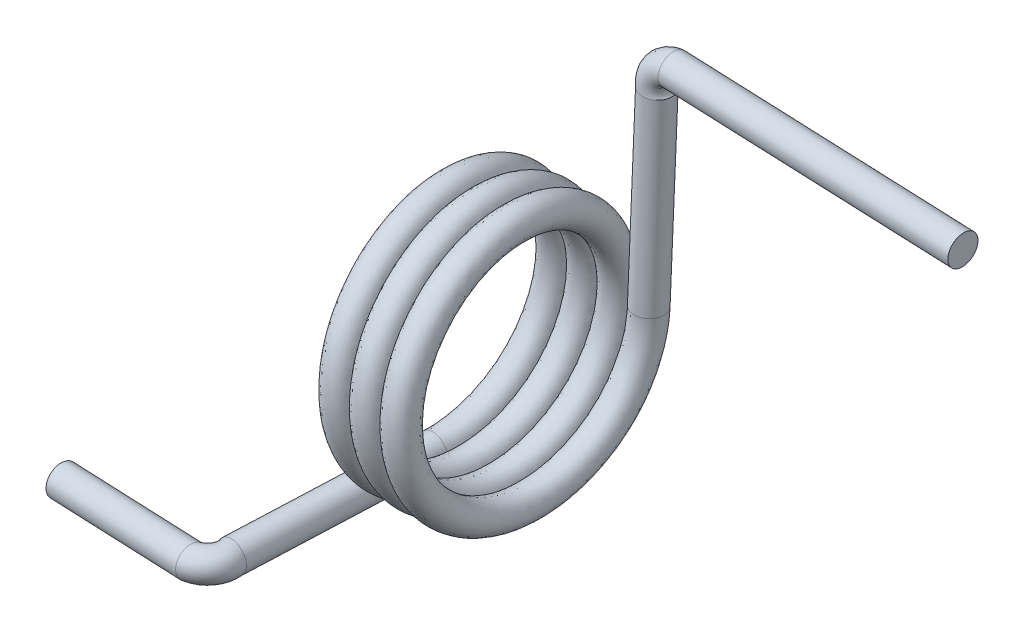
ISO-10303-21;
HEADER;
FILE_DESCRIPTION(('STEP AP214'),'2;1');
FILE_NAME('part.step','',(''),(''),'','','');
FILE_SCHEMA(('AUTOMOTIVE_DESIGN { 1 0 10303 214 1 1 1 1 }'));
ENDSEC;
DATA;
#1=APPLICATION_CONTEXT('core data for automotive mechanical design processes');
#2=APPLICATION_PROTOCOL_DEFINITION('international standard','automotive_design',2000,#1);
#3=PRODUCT_CONTEXT('',#1,'mechanical');
#4=PRODUCT('Part','Part','',(#3));
#5=PRODUCT_RELATED_PRODUCT_CATEGORY('part','',(#4));
#6=PRODUCT_DEFINITION_FORMATION('','',#4);
#7=PRODUCT_DEFINITION_CONTEXT('part definition',#1,'design');
#8=PRODUCT_DEFINITION('design','',#6,#7);
#9=PRODUCT_DEFINITION_SHAPE('','',#8);
#10=(LENGTH_UNIT() NAMED_UNIT(*) SI_UNIT(.MILLI.,.METRE.));
#11=(NAMED_UNIT(*) PLANE_ANGLE_UNIT() SI_UNIT($,.RADIAN.));
#12=(NAMED_UNIT(*) SI_UNIT($,.STERADIAN.) SOLID_ANGLE_UNIT());
#13=UNCERTAINTY_MEASURE_WITH_UNIT(LENGTH_MEASURE(1.E-05),#10,'distance_accuracy_value','');
#14=(GEOMETRIC_REPRESENTATION_CONTEXT(3) GLOBAL_UNCERTAINTY_ASSIGNED_CONTEXT((#13)) GLOBAL_UNIT_ASSIGNED_CONTEXT((#10,
#11,#12)) REPRESENTATION_CONTEXT('',''));
#15=CARTESIAN_POINT('',(0.,0.,0.));
#16=DIRECTION('',(0.,0.,1.));
#17=DIRECTION('',(1.,0.,0.));
#18=AXIS2_PLACEMENT_3D('',#15,#16,#17);
#19=CARTESIAN_POINT('',(-0.989731142426947,-7.62,-0.0414804256277122));
#20=CARTESIAN_POINT('',(-0.822514475760281,-7.59605126509774,-4.44088947685266));
#21=CARTESIAN_POINT('',(-0.655297809093615,-3.77407689764661,-6.61985378965128));
#22=CARTESIAN_POINT('',(-0.488081142426948,0.0478974698045193,-8.7988181024499));
#23=CARTESIAN_POINT('',(-0.320864475760282,3.84592310235339,-6.57837336402357));
#24=CARTESIAN_POINT('',(-0.153647809093616,7.64394873490226,-4.35792862559724));
#25=CARTESIAN_POINT('',(0.0135688575730504,7.62,0.0414804256277113));
#26=CARTESIAN_POINT('',(0.180785524239717,7.59605126509775,4.44088947685266));
#27=CARTESIAN_POINT('',(0.348002190906383,3.77407689764661,6.61985378965128));
#28=CARTESIAN_POINT('',(0.515218857573049,-0.0478974698045182,8.7988181024499));
#29=CARTESIAN_POINT('',(0.682435524239716,-3.84592310235339,6.57837336402357));
#30=CARTESIAN_POINT('',(0.849652190906382,-7.64394873490226,4.35792862559724));
#31=CARTESIAN_POINT('',(1.01686885757305,-7.62,-0.0414804256277122));
#32=CARTESIAN_POINT('',(1.18408552423971,-7.59605126509774,-4.44088947685266));
#33=CARTESIAN_POINT('',(1.35130219090638,-3.77407689764661,-6.61985378965128));
#34=CARTESIAN_POINT('',(1.51851885757305,0.0478974698045193,-8.7988181024499));
#35=CARTESIAN_POINT('',(1.68573552423971,3.84592310235339,-6.57837336402357));
#36=CARTESIAN_POINT('',(1.85295219090638,7.64394873490226,-4.35792862559724));
#37=CARTESIAN_POINT('',(2.02016885757305,7.62,0.0414804256277113));
#38=CARTESIAN_POINT('',(2.18738552423971,7.59605126509775,4.44088947685266));
#39=CARTESIAN_POINT('',(2.35460219090638,3.77407689764661,6.61985378965128));
#40=CARTESIAN_POINT('',(2.52181885757304,-0.0478974698045182,8.7988181024499));
#41=CARTESIAN_POINT('',(2.68903552423971,-3.84592310235339,6.57837336402357));
#42=CARTESIAN_POINT('',(2.85625219090638,-7.64394873490226,4.35792862559724));
#43=CARTESIAN_POINT('',(3.02346885757304,-7.62,-0.0414804256277122));
#44=CARTESIAN_POINT('',(3.19068552423971,-7.59605126509774,-4.44088947685266));
#45=CARTESIAN_POINT('',(3.35790219090638,-3.77407689764661,-6.61985378965128));
#46=CARTESIAN_POINT('',(3.52511885757304,0.0478974698045193,-8.7988181024499));
#47=CARTESIAN_POINT('',(3.69233552423971,3.84592310235339,-6.57837336402357));
#48=CARTESIAN_POINT('',(3.85955219090638,7.64394873490226,-4.35792862559724));
#49=CARTESIAN_POINT('',(4.02676885757304,7.62,0.0414804256277113));
#50=CARTESIAN_POINT('',(4.19398552423971,7.59605126509775,4.44088947685266));
#51=CARTESIAN_POINT('',(4.36120219090637,3.77407689764661,6.61985378965128));
#52=CARTESIAN_POINT('',(4.52841885757304,-0.0478974698045182,8.7988181024499));
#53=CARTESIAN_POINT('',(4.69563552423971,-3.84592310235339,6.57837336402357));
#54=CARTESIAN_POINT('',(4.86285219090637,-7.64394873490226,4.35792862559724));
#55=CARTESIAN_POINT('',(5.03006885757304,-7.62,-0.0414804256277122));
#56=CARTESIAN_POINT('',(5.1972855242397,-7.59605126509774,-4.44088947685266));
#57=CARTESIAN_POINT('',(5.36450219090637,-3.77407689764661,-6.61985378965128));
#58=CARTESIAN_POINT('',(5.53171885757304,0.0478974698045193,-8.7988181024499));
#59=CARTESIAN_POINT('',(5.6989355242397,3.84592310235339,-6.57837336402357));
#60=CARTESIAN_POINT('',(5.86615219090637,7.64394873490226,-4.35792862559724));
#61=CARTESIAN_POINT('',(6.03336885757304,7.62,0.0414804256277113));
#62=CARTESIAN_POINT('',(6.2005855242397,7.59605126509775,4.44088947685266));
#63=CARTESIAN_POINT('',(6.36780219090637,3.77407689764661,6.61985378965128));
#64=CARTESIAN_POINT('',(6.53501885757303,-0.0478974698045182,8.7988181024499));
#65=CARTESIAN_POINT('',(6.7022355242397,-3.84592310235339,6.57837336402357));
#66=CARTESIAN_POINT('',(6.86945219090637,-7.64394873490226,4.35792862559724));
#67=CARTESIAN_POINT('',(7.03666885757303,-7.62,-0.0414804256277122));
#68=CARTESIAN_POINT('',(-0.989731142426948,-5.6388,-0.0414804256276918));
#69=CARTESIAN_POINT('',(-0.822514475760282,-5.61485126509776,-3.29704312353415));
#70=CARTESIAN_POINT('',(-0.655297809093615,-2.78347689764663,-4.90408425967354));
#71=CARTESIAN_POINT('',(-0.488081142426949,0.0478974698044959,-6.51112539581293));
#72=CARTESIAN_POINT('',(-0.320864475760283,2.85532310235337,-4.86260383404585));
#73=CARTESIAN_POINT('',(-0.153647809093617,5.66274873490225,-3.21408227227877));
#74=CARTESIAN_POINT('',(0.0135688575730495,5.6388,0.0414804256276912));
#75=CARTESIAN_POINT('',(0.180785524239716,5.61485126509776,3.29704312353415));
#76=CARTESIAN_POINT('',(0.348002190906382,2.78347689764663,4.90408425967354));
#77=CARTESIAN_POINT('',(0.515218857573049,-0.0478974698044951,6.51112539581293));
#78=CARTESIAN_POINT('',(0.682435524239715,-2.85532310235337,4.86260383404585));
#79=CARTESIAN_POINT('',(0.849652190906381,-5.66274873490225,3.21408227227877));
#80=CARTESIAN_POINT('',(1.01686885757305,-5.6388,-0.0414804256276918));
#81=CARTESIAN_POINT('',(1.18408552423971,-5.61485126509776,-3.29704312353415));
#82=CARTESIAN_POINT('',(1.35130219090638,-2.78347689764663,-4.90408425967354));
#83=CARTESIAN_POINT('',(1.51851885757305,0.0478974698044959,-6.51112539581293));
#84=CARTESIAN_POINT('',(1.68573552423971,2.85532310235337,-4.86260383404585));
#85=CARTESIAN_POINT('',(1.85295219090638,5.66274873490225,-3.21408227227877));
#86=CARTESIAN_POINT('',(2.02016885757304,5.6388,0.0414804256276912));
#87=CARTESIAN_POINT('',(2.18738552423971,5.61485126509776,3.29704312353415));
#88=CARTESIAN_POINT('',(2.35460219090638,2.78347689764663,4.90408425967354));
#89=CARTESIAN_POINT('',(2.52181885757304,-0.0478974698044951,6.51112539581293));
#90=CARTESIAN_POINT('',(2.68903552423971,-2.85532310235337,4.86260383404585));
#91=CARTESIAN_POINT('',(2.85625219090638,-5.66274873490225,3.21408227227877));
#92=CARTESIAN_POINT('',(3.02346885757304,-5.6388,-0.0414804256276918));
#93=CARTESIAN_POINT('',(3.19068552423971,-5.61485126509776,-3.29704312353415));
#94=CARTESIAN_POINT('',(3.35790219090638,-2.78347689764663,-4.90408425967354));
#95=CARTESIAN_POINT('',(3.52511885757304,0.0478974698044959,-6.51112539581293));
#96=CARTESIAN_POINT('',(3.69233552423971,2.85532310235337,-4.86260383404585));
#97=CARTESIAN_POINT('',(3.85955219090637,5.66274873490225,-3.21408227227877));
#98=CARTESIAN_POINT('',(4.02676885757304,5.6388,0.0414804256276912));
#99=CARTESIAN_POINT('',(4.19398552423971,5.61485126509776,3.29704312353415));
#100=CARTESIAN_POINT('',(4.36120219090637,2.78347689764663,4.90408425967354));
#101=CARTESIAN_POINT('',(4.52841885757304,-0.0478974698044951,6.51112539581293));
#102=CARTESIAN_POINT('',(4.69563552423971,-2.85532310235337,4.86260383404585));
#103=CARTESIAN_POINT('',(4.86285219090637,-5.66274873490225,3.21408227227877));
#104=CARTESIAN_POINT('',(5.03006885757304,-5.6388,-0.0414804256276918));
#105=CARTESIAN_POINT('',(5.1972855242397,-5.61485126509776,-3.29704312353415));
#106=CARTESIAN_POINT('',(5.36450219090637,-2.78347689764663,-4.90408425967354));
#107=CARTESIAN_POINT('',(5.53171885757304,0.0478974698044959,-6.51112539581293));
#108=CARTESIAN_POINT('',(5.6989355242397,2.85532310235337,-4.86260383404585));
#109=CARTESIAN_POINT('',(5.86615219090637,5.66274873490225,-3.21408227227877));
#110=CARTESIAN_POINT('',(6.03336885757304,5.6388,0.0414804256276912));
#111=CARTESIAN_POINT('',(6.2005855242397,5.61485126509776,3.29704312353415));
#112=CARTESIAN_POINT('',(6.36780219090637,2.78347689764663,4.90408425967354));
#113=CARTESIAN_POINT('',(6.53501885757303,-0.0478974698044951,6.51112539581293));
#114=CARTESIAN_POINT('',(6.7022355242397,-2.85532310235337,4.86260383404585));
#115=CARTESIAN_POINT('',(6.86945219090637,-5.66274873490225,3.21408227227877));
#116=CARTESIAN_POINT('',(7.03666885757303,-5.6388,-0.0414804256276918));
#117=CARTESIAN_POINT('',(0.989731142426946,-5.6388,0.041480425627573));
#118=CARTESIAN_POINT('',(1.15694780909361,-5.66274873490218,-3.21408227227889));
#119=CARTESIAN_POINT('',(1.32416447576028,-2.85532310235327,-4.86260383404591));
#120=CARTESIAN_POINT('',(1.49138114242695,-0.0478974698043594,-6.51112539581293));
#121=CARTESIAN_POINT('',(1.65859780909361,2.78347689764673,-4.90408425967348));
#122=CARTESIAN_POINT('',(1.82581447576028,5.61485126509782,-3.29704312353404));
#123=CARTESIAN_POINT('',(1.99303114242694,5.6388,-0.0414804256275737));
#124=CARTESIAN_POINT('',(2.16024780909361,5.66274873490218,3.21408227227889));
#125=CARTESIAN_POINT('',(2.32746447576028,2.85532310235327,4.86260383404591));
#126=CARTESIAN_POINT('',(2.49468114242694,0.0478974698043602,6.51112539581293));
#127=CARTESIAN_POINT('',(2.66189780909361,-2.78347689764673,4.90408425967348));
#128=CARTESIAN_POINT('',(2.82911447576028,-5.61485126509782,3.29704312353404));
#129=CARTESIAN_POINT('',(2.99633114242694,-5.6388,0.041480425627573));
#130=CARTESIAN_POINT('',(3.16354780909361,-5.66274873490218,-3.21408227227889));
#131=CARTESIAN_POINT('',(3.33076447576027,-2.85532310235327,-4.86260383404591));
#132=CARTESIAN_POINT('',(3.49798114242694,-0.0478974698043594,-6.51112539581293));
#133=CARTESIAN_POINT('',(3.66519780909361,2.78347689764673,-4.90408425967348));
#134=CARTESIAN_POINT('',(3.83241447576027,5.61485126509782,-3.29704312353404));
#135=CARTESIAN_POINT('',(3.99963114242694,5.6388,-0.0414804256275737));
#136=CARTESIAN_POINT('',(4.16684780909361,5.66274873490218,3.21408227227889));
#137=CARTESIAN_POINT('',(4.33406447576027,2.85532310235327,4.86260383404591));
#138=CARTESIAN_POINT('',(4.50128114242694,0.0478974698043602,6.51112539581293));
#139=CARTESIAN_POINT('',(4.6684978090936,-2.78347689764673,4.90408425967348));
#140=CARTESIAN_POINT('',(4.83571447576027,-5.61485126509782,3.29704312353404));
#141=CARTESIAN_POINT('',(5.00293114242694,-5.6388,0.041480425627573));
#142=CARTESIAN_POINT('',(5.1701478090936,-5.66274873490218,-3.21408227227889));
#143=CARTESIAN_POINT('',(5.33736447576027,-2.85532310235327,-4.86260383404591));
#144=CARTESIAN_POINT('',(5.50458114242694,-0.0478974698043594,-6.51112539581293));
#145=CARTESIAN_POINT('',(5.6717978090936,2.78347689764673,-4.90408425967348));
#146=CARTESIAN_POINT('',(5.83901447576027,5.61485126509782,-3.29704312353404));
#147=CARTESIAN_POINT('',(6.00623114242693,5.6388,-0.0414804256275737));
#148=CARTESIAN_POINT('',(6.1734478090936,5.66274873490218,3.21408227227889));
#149=CARTESIAN_POINT('',(6.34066447576027,2.85532310235327,4.86260383404591));
#150=CARTESIAN_POINT('',(6.50788114242693,0.0478974698043602,6.51112539581293));
#151=CARTESIAN_POINT('',(6.6750978090936,-2.78347689764673,4.90408425967348));
#152=CARTESIAN_POINT('',(6.84231447576027,-5.61485126509782,3.29704312353404));
#153=CARTESIAN_POINT('',(7.00953114242693,-5.6388,0.041480425627573));
#154=CARTESIAN_POINT('',(7.1767478090936,-5.66274873490218,-3.21408227227889));
#155=CARTESIAN_POINT('',(7.34396447576026,-2.85532310235327,-4.86260383404591));
#156=CARTESIAN_POINT('',(7.51118114242693,-0.0478974698043594,-6.51112539581293));
#157=CARTESIAN_POINT('',(7.6783978090936,2.78347689764673,-4.90408425967348));
#158=CARTESIAN_POINT('',(7.84561447576026,5.61485126509782,-3.29704312353404));
#159=CARTESIAN_POINT('',(8.01283114242693,5.6388,-0.0414804256275737));
#160=CARTESIAN_POINT('',(8.1800478090936,5.66274873490218,3.21408227227889));
#161=CARTESIAN_POINT('',(8.34726447576026,2.85532310235327,4.86260383404591));
#162=CARTESIAN_POINT('',(8.51448114242693,0.0478974698043602,6.51112539581293));
#163=CARTESIAN_POINT('',(8.6816978090936,-2.78347689764673,4.90408425967348));
#164=CARTESIAN_POINT('',(8.84891447576026,-5.61485126509782,3.29704312353404));
#165=CARTESIAN_POINT('',(9.01613114242693,-5.6388,0.041480425627573));
#166=CARTESIAN_POINT('',(0.989731142426948,-7.62,0.0414804256275526));
#167=CARTESIAN_POINT('',(1.15694780909361,-7.64394873490217,-4.3579286255974));
#168=CARTESIAN_POINT('',(1.32416447576028,-3.84592310235325,-6.57837336402365));
#169=CARTESIAN_POINT('',(1.49138114242695,-0.047897469804336,-8.7988181024499));
#170=CARTESIAN_POINT('',(1.65859780909361,3.77407689764675,-6.6198537896512));
#171=CARTESIAN_POINT('',(1.82581447576028,7.59605126509783,-4.4408894768525));
#172=CARTESIAN_POINT('',(1.99303114242695,7.62,-0.0414804256275535));
#173=CARTESIAN_POINT('',(2.16024780909361,7.64394873490217,4.35792862559739));
#174=CARTESIAN_POINT('',(2.32746447576028,3.84592310235326,6.57837336402365));
#175=CARTESIAN_POINT('',(2.49468114242694,0.0478974698043371,8.7988181024499));
#176=CARTESIAN_POINT('',(2.66189780909361,-3.77407689764674,6.6198537896512));
#177=CARTESIAN_POINT('',(2.82911447576028,-7.59605126509783,4.44088947685251));
#178=CARTESIAN_POINT('',(2.99633114242694,-7.62,0.0414804256275526));
#179=CARTESIAN_POINT('',(3.16354780909361,-7.64394873490217,-4.3579286255974));
#180=CARTESIAN_POINT('',(3.33076447576028,-3.84592310235325,-6.57837336402365));
#181=CARTESIAN_POINT('',(3.49798114242694,-0.047897469804336,-8.7988181024499));
#182=CARTESIAN_POINT('',(3.66519780909361,3.77407689764675,-6.6198537896512));
#183=CARTESIAN_POINT('',(3.83241447576027,7.59605126509783,-4.4408894768525));
#184=CARTESIAN_POINT('',(3.99963114242694,7.62,-0.0414804256275535));
#185=CARTESIAN_POINT('',(4.16684780909361,7.64394873490217,4.35792862559739));
#186=CARTESIAN_POINT('',(4.33406447576027,3.84592310235326,6.57837336402365));
#187=CARTESIAN_POINT('',(4.50128114242694,0.0478974698043371,8.7988181024499));
#188=CARTESIAN_POINT('',(4.6684978090936,-3.77407689764674,6.6198537896512));
#189=CARTESIAN_POINT('',(4.83571447576027,-7.59605126509783,4.44088947685251));
#190=CARTESIAN_POINT('',(5.00293114242694,-7.62,0.0414804256275526));
#191=CARTESIAN_POINT('',(5.1701478090936,-7.64394873490217,-4.3579286255974));
#192=CARTESIAN_POINT('',(5.33736447576027,-3.84592310235325,-6.57837336402365));
#193=CARTESIAN_POINT('',(5.50458114242694,-0.047897469804336,-8.7988181024499));
#194=CARTESIAN_POINT('',(5.6717978090936,3.77407689764675,-6.6198537896512));
#195=CARTESIAN_POINT('',(5.83901447576027,7.59605126509783,-4.4408894768525));
#196=CARTESIAN_POINT('',(6.00623114242694,7.62,-0.0414804256275535));
#197=CARTESIAN_POINT('',(6.1734478090936,7.64394873490217,4.35792862559739));
#198=CARTESIAN_POINT('',(6.34066447576027,3.84592310235326,6.57837336402365));
#199=CARTESIAN_POINT('',(6.50788114242693,0.0478974698043371,8.7988181024499));
#200=CARTESIAN_POINT('',(6.6750978090936,-3.77407689764674,6.6198537896512));
#201=CARTESIAN_POINT('',(6.84231447576027,-7.59605126509783,4.44088947685251));
#202=CARTESIAN_POINT('',(7.00953114242693,-7.62,0.0414804256275526));
#203=CARTESIAN_POINT('',(7.1767478090936,-7.64394873490217,-4.3579286255974));
#204=CARTESIAN_POINT('',(7.34396447576027,-3.84592310235325,-6.57837336402365));
#205=CARTESIAN_POINT('',(7.51118114242693,-0.047897469804336,-8.7988181024499));
#206=CARTESIAN_POINT('',(7.6783978090936,3.77407689764675,-6.6198537896512));
#207=CARTESIAN_POINT('',(7.84561447576027,7.59605126509783,-4.4408894768525));
#208=CARTESIAN_POINT('',(8.01283114242693,7.62,-0.0414804256275535));
#209=CARTESIAN_POINT('',(8.1800478090936,7.64394873490217,4.35792862559739));
#210=CARTESIAN_POINT('',(8.34726447576026,3.84592310235326,6.57837336402365));
#211=CARTESIAN_POINT('',(8.51448114242693,0.0478974698043371,8.7988181024499));
#212=CARTESIAN_POINT('',(8.6816978090936,-3.77407689764674,6.6198537896512));
#213=CARTESIAN_POINT('',(8.84891447576026,-7.59605126509783,4.44088947685251));
#214=CARTESIAN_POINT('',(9.01613114242693,-7.62,0.0414804256275526));
#215=CARTESIAN_POINT('',(0.989731142426949,-9.6012,0.0414804256275322));
#216=CARTESIAN_POINT('',(1.15694780909361,-9.62514873490216,-5.5017749789159));
#217=CARTESIAN_POINT('',(1.32416447576028,-4.83652310235324,-8.29414289400139));
#218=CARTESIAN_POINT('',(1.49138114242695,-0.0478974698043126,-11.0865108090869));
#219=CARTESIAN_POINT('',(1.65859780909361,4.76467689764677,-8.33562331962892));
#220=CARTESIAN_POINT('',(1.82581447576028,9.57725126509784,-5.58473583017097));
#221=CARTESIAN_POINT('',(1.99303114242695,9.6012,-0.0414804256275334));
#222=CARTESIAN_POINT('',(2.16024780909361,9.62514873490216,5.5017749789159));
#223=CARTESIAN_POINT('',(2.32746447576028,4.83652310235324,8.29414289400139));
#224=CARTESIAN_POINT('',(2.49468114242695,0.047897469804314,11.0865108090869));
#225=CARTESIAN_POINT('',(2.66189780909361,-4.76467689764676,8.33562331962892));
#226=CARTESIAN_POINT('',(2.82911447576028,-9.57725126509784,5.58473583017097));
#227=CARTESIAN_POINT('',(2.99633114242694,-9.6012,0.0414804256275322));
#228=CARTESIAN_POINT('',(3.16354780909361,-9.62514873490216,-5.5017749789159));
#229=CARTESIAN_POINT('',(3.33076447576028,-4.83652310235324,-8.29414289400139));
#230=CARTESIAN_POINT('',(3.49798114242694,-0.0478974698043126,-11.0865108090869));
#231=CARTESIAN_POINT('',(3.66519780909361,4.76467689764677,-8.33562331962892));
#232=CARTESIAN_POINT('',(3.83241447576028,9.57725126509784,-5.58473583017097));
#233=CARTESIAN_POINT('',(3.99963114242694,9.6012,-0.0414804256275334));
#234=CARTESIAN_POINT('',(4.16684780909361,9.62514873490216,5.5017749789159));
#235=CARTESIAN_POINT('',(4.33406447576027,4.83652310235324,8.29414289400139));
#236=CARTESIAN_POINT('',(4.50128114242694,0.047897469804314,11.0865108090869));
#237=CARTESIAN_POINT('',(4.66849780909361,-4.76467689764676,8.33562331962892));
#238=CARTESIAN_POINT('',(4.83571447576027,-9.57725126509784,5.58473583017097));
#239=CARTESIAN_POINT('',(5.00293114242694,-9.6012,0.0414804256275322));
#240=CARTESIAN_POINT('',(5.17014780909361,-9.62514873490216,-5.5017749789159));
#241=CARTESIAN_POINT('',(5.33736447576027,-4.83652310235324,-8.29414289400139));
#242=CARTESIAN_POINT('',(5.50458114242694,-0.0478974698043126,-11.0865108090869));
#243=CARTESIAN_POINT('',(5.6717978090936,4.76467689764677,-8.33562331962892));
#244=CARTESIAN_POINT('',(5.83901447576027,9.57725126509784,-5.58473583017097));
#245=CARTESIAN_POINT('',(6.00623114242694,9.6012,-0.0414804256275334));
#246=CARTESIAN_POINT('',(6.1734478090936,9.62514873490216,5.5017749789159));
#247=CARTESIAN_POINT('',(6.34066447576027,4.83652310235324,8.29414289400139));
#248=CARTESIAN_POINT('',(6.50788114242693,0.047897469804314,11.0865108090869));
#249=CARTESIAN_POINT('',(6.6750978090936,-4.76467689764676,8.33562331962892));
#250=CARTESIAN_POINT('',(6.84231447576027,-9.57725126509784,5.58473583017097));
#251=CARTESIAN_POINT('',(7.00953114242694,-9.6012,0.0414804256275322));
#252=CARTESIAN_POINT('',(7.1767478090936,-9.62514873490216,-5.5017749789159));
#253=CARTESIAN_POINT('',(7.34396447576027,-4.83652310235324,-8.29414289400139));
#254=CARTESIAN_POINT('',(7.51118114242693,-0.0478974698043126,-11.0865108090869));
#255=CARTESIAN_POINT('',(7.6783978090936,4.76467689764677,-8.33562331962892));
#256=CARTESIAN_POINT('',(7.84561447576027,9.57725126509784,-5.58473583017097));
#257=CARTESIAN_POINT('',(8.01283114242693,9.6012,-0.0414804256275334));
#258=CARTESIAN_POINT('',(8.1800478090936,9.62514873490216,5.5017749789159));
#259=CARTESIAN_POINT('',(8.34726447576026,4.83652310235324,8.29414289400139));
#260=CARTESIAN_POINT('',(8.51448114242693,0.047897469804314,11.0865108090869));
#261=CARTESIAN_POINT('',(8.6816978090936,-4.76467689764676,8.33562331962892));
#262=CARTESIAN_POINT('',(8.84891447576026,-9.57725126509784,5.58473583017097));
#263=CARTESIAN_POINT('',(9.01613114242693,-9.6012,0.0414804256275322));
#264=CARTESIAN_POINT('',(-0.989731142426946,-9.6012,-0.0414804256277326));
#265=CARTESIAN_POINT('',(-0.82251447576028,-9.57725126509773,-5.58473583017117));
#266=CARTESIAN_POINT('',(-0.655297809093614,-4.76467689764659,-8.33562331962902));
#267=CARTESIAN_POINT('',(-0.488081142426948,0.0478974698045427,-11.0865108090869));
#268=CARTESIAN_POINT('',(-0.320864475760281,4.83652310235341,-8.29414289400129));
#269=CARTESIAN_POINT('',(-0.153647809093615,9.62514873490227,-5.50177497891571));
#270=CARTESIAN_POINT('',(0.0135688575730512,9.6012,0.0414804256277314));
#271=CARTESIAN_POINT('',(0.180785524239718,9.57725126509773,5.58473583017117));
#272=CARTESIAN_POINT('',(0.348002190906384,4.7646768976466,8.33562331962902));
#273=CARTESIAN_POINT('',(0.51521885757305,-0.0478974698045413,11.0865108090869));
#274=CARTESIAN_POINT('',(0.682435524239716,-4.8365231023534,8.29414289400129));
#275=CARTESIAN_POINT('',(0.849652190906383,-9.62514873490227,5.50177497891571));
#276=CARTESIAN_POINT('',(1.01686885757305,-9.6012,-0.0414804256277326));
#277=CARTESIAN_POINT('',(1.18408552423972,-9.57725126509773,-5.58473583017117));
#278=CARTESIAN_POINT('',(1.35130219090638,-4.76467689764659,-8.33562331962902));
#279=CARTESIAN_POINT('',(1.51851885757305,0.0478974698045427,-11.0865108090869));
#280=CARTESIAN_POINT('',(1.68573552423971,4.83652310235341,-8.29414289400129));
#281=CARTESIAN_POINT('',(1.85295219090638,9.62514873490227,-5.50177497891571));
#282=CARTESIAN_POINT('',(2.02016885757305,9.6012,0.0414804256277314));
#283=CARTESIAN_POINT('',(2.18738552423971,9.57725126509773,5.58473583017117));
#284=CARTESIAN_POINT('',(2.35460219090638,4.7646768976466,8.33562331962902));
#285=CARTESIAN_POINT('',(2.52181885757305,-0.0478974698045413,11.0865108090869));
#286=CARTESIAN_POINT('',(2.68903552423971,-4.8365231023534,8.29414289400129));
#287=CARTESIAN_POINT('',(2.85625219090638,-9.62514873490227,5.50177497891571));
#288=CARTESIAN_POINT('',(3.02346885757304,-9.6012,-0.0414804256277326));
#289=CARTESIAN_POINT('',(3.19068552423971,-9.57725126509773,-5.58473583017117));
#290=CARTESIAN_POINT('',(3.35790219090638,-4.76467689764659,-8.33562331962902));
#291=CARTESIAN_POINT('',(3.52511885757304,0.0478974698045427,-11.0865108090869));
#292=CARTESIAN_POINT('',(3.69233552423971,4.83652310235341,-8.29414289400129));
#293=CARTESIAN_POINT('',(3.85955219090638,9.62514873490227,-5.50177497891571));
#294=CARTESIAN_POINT('',(4.02676885757304,9.6012,0.0414804256277314));
#295=CARTESIAN_POINT('',(4.19398552423971,9.57725126509773,5.58473583017117));
#296=CARTESIAN_POINT('',(4.36120219090637,4.7646768976466,8.33562331962902));
#297=CARTESIAN_POINT('',(4.52841885757304,-0.0478974698045413,11.0865108090869));
#298=CARTESIAN_POINT('',(4.69563552423971,-4.8365231023534,8.29414289400129));
#299=CARTESIAN_POINT('',(4.86285219090637,-9.62514873490227,5.50177497891571));
#300=CARTESIAN_POINT('',(5.03006885757304,-9.6012,-0.0414804256277326));
#301=CARTESIAN_POINT('',(5.1972855242397,-9.57725126509773,-5.58473583017117));
#302=CARTESIAN_POINT('',(5.36450219090637,-4.76467689764659,-8.33562331962902));
#303=CARTESIAN_POINT('',(5.53171885757304,0.0478974698045427,-11.0865108090869));
#304=CARTESIAN_POINT('',(5.6989355242397,4.83652310235341,-8.29414289400129));
#305=CARTESIAN_POINT('',(5.86615219090637,9.62514873490227,-5.50177497891571));
#306=CARTESIAN_POINT('',(6.03336885757304,9.6012,0.0414804256277314));
#307=CARTESIAN_POINT('',(6.2005855242397,9.57725126509773,5.58473583017117));
#308=CARTESIAN_POINT('',(6.36780219090637,4.7646768976466,8.33562331962902));
#309=CARTESIAN_POINT('',(6.53501885757303,-0.0478974698045413,11.0865108090869));
#310=CARTESIAN_POINT('',(6.7022355242397,-4.8365231023534,8.29414289400129));
#311=CARTESIAN_POINT('',(6.86945219090637,-9.62514873490227,5.50177497891571));
#312=CARTESIAN_POINT('',(7.03666885757304,-9.6012,-0.0414804256277326));
#313=CARTESIAN_POINT('',(-0.989731142426947,-7.62,-0.0414804256277122));
#314=CARTESIAN_POINT('',(-0.822514475760281,-7.59605126509774,-4.44088947685266));
#315=CARTESIAN_POINT('',(-0.655297809093615,-3.77407689764661,-6.61985378965128));
#316=CARTESIAN_POINT('',(-0.488081142426948,0.0478974698045193,-8.7988181024499));
#317=CARTESIAN_POINT('',(-0.320864475760282,3.84592310235339,-6.57837336402357));
#318=CARTESIAN_POINT('',(-0.153647809093616,7.64394873490226,-4.35792862559724));
#319=CARTESIAN_POINT('',(0.0135688575730504,7.62,0.0414804256277113));
#320=CARTESIAN_POINT('',(0.180785524239717,7.59605126509775,4.44088947685266));
#321=CARTESIAN_POINT('',(0.348002190906383,3.77407689764661,6.61985378965128));
#322=CARTESIAN_POINT('',(0.515218857573049,-0.0478974698045182,8.7988181024499));
#323=CARTESIAN_POINT('',(0.682435524239716,-3.84592310235339,6.57837336402357));
#324=CARTESIAN_POINT('',(0.849652190906382,-7.64394873490226,4.35792862559724));
#325=CARTESIAN_POINT('',(1.01686885757305,-7.62,-0.0414804256277122));
#326=CARTESIAN_POINT('',(1.18408552423971,-7.59605126509774,-4.44088947685266));
#327=CARTESIAN_POINT('',(1.35130219090638,-3.77407689764661,-6.61985378965128));
#328=CARTESIAN_POINT('',(1.51851885757305,0.0478974698045193,-8.7988181024499));
#329=CARTESIAN_POINT('',(1.68573552423971,3.84592310235339,-6.57837336402357));
#330=CARTESIAN_POINT('',(1.85295219090638,7.64394873490226,-4.35792862559724));
#331=CARTESIAN_POINT('',(2.02016885757305,7.62,0.0414804256277113));
#332=CARTESIAN_POINT('',(2.18738552423971,7.59605126509775,4.44088947685266));
#333=CARTESIAN_POINT('',(2.35460219090638,3.77407689764661,6.61985378965128));
#334=CARTESIAN_POINT('',(2.52181885757304,-0.0478974698045182,8.7988181024499));
#335=CARTESIAN_POINT('',(2.68903552423971,-3.84592310235339,6.57837336402357));
#336=CARTESIAN_POINT('',(2.85625219090638,-7.64394873490226,4.35792862559724));
#337=CARTESIAN_POINT('',(3.02346885757304,-7.62,-0.0414804256277122));
#338=CARTESIAN_POINT('',(3.19068552423971,-7.59605126509774,-4.44088947685266));
#339=CARTESIAN_POINT('',(3.35790219090638,-3.77407689764661,-6.61985378965128));
#340=CARTESIAN_POINT('',(3.52511885757304,0.0478974698045193,-8.7988181024499));
#341=CARTESIAN_POINT('',(3.69233552423971,3.84592310235339,-6.57837336402357));
#342=CARTESIAN_POINT('',(3.85955219090638,7.64394873490226,-4.35792862559724));
#343=CARTESIAN_POINT('',(4.02676885757304,7.62,0.0414804256277113));
#344=CARTESIAN_POINT('',(4.19398552423971,7.59605126509775,4.44088947685266));
#345=CARTESIAN_POINT('',(4.36120219090637,3.77407689764661,6.61985378965128));
#346=CARTESIAN_POINT('',(4.52841885757304,-0.0478974698045182,8.7988181024499));
#347=CARTESIAN_POINT('',(4.69563552423971,-3.84592310235339,6.57837336402357));
#348=CARTESIAN_POINT('',(4.86285219090637,-7.64394873490226,4.35792862559724));
#349=CARTESIAN_POINT('',(5.03006885757304,-7.62,-0.0414804256277122));
#350=CARTESIAN_POINT('',(5.1972855242397,-7.59605126509774,-4.44088947685266));
#351=CARTESIAN_POINT('',(5.36450219090637,-3.77407689764661,-6.61985378965128));
#352=CARTESIAN_POINT('',(5.53171885757304,0.0478974698045193,-8.7988181024499));
#353=CARTESIAN_POINT('',(5.6989355242397,3.84592310235339,-6.57837336402357));
#354=CARTESIAN_POINT('',(5.86615219090637,7.64394873490226,-4.35792862559724));
#355=CARTESIAN_POINT('',(6.03336885757304,7.62,0.0414804256277113));
#356=CARTESIAN_POINT('',(6.2005855242397,7.59605126509775,4.44088947685266));
#357=CARTESIAN_POINT('',(6.36780219090637,3.77407689764661,6.61985378965128));
#358=CARTESIAN_POINT('',(6.53501885757303,-0.0478974698045182,8.7988181024499));
#359=CARTESIAN_POINT('',(6.7022355242397,-3.84592310235339,6.57837336402357));
#360=CARTESIAN_POINT('',(6.86945219090637,-7.64394873490226,4.35792862559724));
#361=CARTESIAN_POINT('',(7.03666885757303,-7.62,-0.0414804256277122));
#362=(BOUNDED_SURFACE() B_SPLINE_SURFACE(3,2,((#19,#20,#21,#22,#23,#24,#25,#26,#27,#28,#29,#30,
#31,#32,#33,#34,#35,#36,#37,#38,#39,#40,#41,#42,#43,#44,#45,#46,#47,#48,#49,#50,#51,#52,#53,#54,
#55,#56,#57,#58,#59,#60,#61,#62,#63,#64,#65,#66,#67),(#68,#69,#70,#71,#72,#73,#74,#75,#76,#77,
#78,#79,#80,#81,#82,#83,#84,#85,#86,#87,#88,#89,#90,#91,#92,#93,#94,#95,#96,#97,#98,#99,#100,
#101,#102,#103,#104,#105,#106,#107,#108,#109,#110,#111,#112,#113,#114,#115,#116),(#117,#118,
#119,#120,#121,#122,#123,#124,#125,#126,#127,#128,#129,#130,#131,#132,#133,#134,#135,#136,#137,
#138,#139,#140,#141,#142,#143,#144,#145,#146,#147,#148,#149,#150,#151,#152,#153,#154,#155,#156,
#157,#158,#159,#160,#161,#162,#163,#164,#165),(#166,#167,#168,#169,#170,#171,#172,#173,#174,
#175,#176,#177,#178,#179,#180,#181,#182,#183,#184,#185,#186,#187,#188,#189,#190,#191,#192,#193,
#194,#195,#196,#197,#198,#199,#200,#201,#202,#203,#204,#205,#206,#207,#208,#209,#210,#211,#212,
#213,#214),(#215,#216,#217,#218,#219,#220,#221,#222,#223,#224,#225,#226,#227,#228,#229,#230,
#231,#232,#233,#234,#235,#236,#237,#238,#239,#240,#241,#242,#243,#244,#245,#246,#247,#248,#249,
#250,#251,#252,#253,#254,#255,#256,#257,#258,#259,#260,#261,#262,#263),(#264,#265,#266,#267,
#268,#269,#270,#271,#272,#273,#274,#275,#276,#277,#278,#279,#280,#281,#282,#283,#284,#285,#286,
#287,#288,#289,#290,#291,#292,#293,#294,#295,#296,#297,#298,#299,#300,#301,#302,#303,#304,#305,
#306,#307,#308,#309,#310,#311,#312),(#313,#314,#315,#316,#317,#318,#319,#320,#321,#322,#323,
#324,#325,#326,#327,#328,#329,#330,#331,#332,#333,#334,#335,#336,#337,#338,#339,#340,#341,#342,
#343,#344,#345,#346,#347,#348,#349,#350,#351,#352,#353,#354,#355,#356,#357,#358,#359,#360,
#361)),.UNSPECIFIED.,.T.,.F.,.F.) B_SPLINE_SURFACE_WITH_KNOTS((4,3,4),(3,2,2,2,2,2,2,2,2,2,2,2,
2,2,2,2,2,2,2,2,2,2,2,2,3),(0.,0.5,1.),(0.,0.0416666666666667,0.0833333333333333,0.125,
0.166666666666667,0.208333333333333,0.25,0.291666666666667,0.333333333333333,0.375,
0.416666666666667,0.458333333333333,0.5,0.541666666666667,0.583333333333333,0.625,
0.666666666666667,0.708333333333333,0.75,0.791666666666667,0.833333333333333,0.875,
0.916666666666667,0.958333333333333,1.),
.UNSPECIFIED.) GEOMETRIC_REPRESENTATION_ITEM() RATIONAL_B_SPLINE_SURFACE(((1.,0.866025403784439,
1.,0.866025403784439,1.,0.866025403784439,1.,0.866025403784439,1.,0.866025403784439,1.,
0.866025403784439,1.,0.866025403784439,1.,0.866025403784439,1.,0.866025403784439,1.,
0.866025403784439,1.,0.866025403784439,1.,0.866025403784439,1.,0.866025403784439,1.,
0.866025403784439,1.,0.866025403784439,1.,0.866025403784439,1.,0.866025403784439,1.,
0.866025403784439,1.,0.866025403784439,1.,0.866025403784439,1.,0.866025403784439,1.,
0.866025403784439,1.,0.866025403784439,1.,0.866025403784439,1.),(0.333333333333333,
0.288675134594813,0.333333333333333,0.288675134594813,0.333333333333333,0.288675134594813,
0.333333333333333,0.288675134594813,0.333333333333333,0.288675134594813,0.333333333333333,
0.288675134594813,0.333333333333333,0.288675134594813,0.333333333333333,0.288675134594813,
0.333333333333333,0.288675134594813,0.333333333333333,0.288675134594813,0.333333333333333,
0.288675134594813,0.333333333333333,0.288675134594813,0.333333333333333,0.288675134594813,
0.333333333333333,0.288675134594813,0.333333333333333,0.288675134594813,0.333333333333333,
0.288675134594813,0.333333333333333,0.288675134594813,0.333333333333333,0.288675134594813,
0.333333333333333,0.288675134594813,0.333333333333333,0.288675134594813,0.333333333333333,
0.288675134594813,0.333333333333333,0.288675134594813,0.333333333333333,0.288675134594813,
0.333333333333333,0.288675134594813,0.333333333333333),(0.333333333333333,0.288675134594813,
0.333333333333333,0.288675134594813,0.333333333333333,0.288675134594813,0.333333333333333,
0.288675134594813,0.333333333333333,0.288675134594813,0.333333333333333,0.288675134594813,
0.333333333333333,0.288675134594813,0.333333333333333,0.288675134594813,0.333333333333333,
0.288675134594813,0.333333333333333,0.288675134594813,0.333333333333333,0.288675134594813,
0.333333333333333,0.288675134594813,0.333333333333333,0.288675134594813,0.333333333333333,
0.288675134594813,0.333333333333333,0.288675134594813,0.333333333333333,0.288675134594813,
0.333333333333333,0.288675134594813,0.333333333333333,0.288675134594813,0.333333333333333,
0.288675134594813,0.333333333333333,0.288675134594813,0.333333333333333,0.288675134594813,
0.333333333333333,0.288675134594813,0.333333333333333,0.288675134594813,0.333333333333333,
0.288675134594813,0.333333333333333),(1.,0.866025403784439,1.,0.866025403784439,1.,
0.866025403784439,1.,0.866025403784439,1.,0.866025403784439,1.,0.866025403784439,1.,
0.866025403784439,1.,0.866025403784439,1.,0.866025403784439,1.,0.866025403784439,1.,
0.866025403784439,1.,0.866025403784439,1.,0.866025403784439,1.,0.866025403784439,1.,
0.866025403784439,1.,0.866025403784439,1.,0.866025403784439,1.,0.866025403784439,1.,
0.866025403784439,1.,0.866025403784439,1.,0.866025403784439,1.,0.866025403784439,1.,
0.866025403784439,1.,0.866025403784439,1.),(0.333333333333333,0.288675134594813,
0.333333333333333,0.288675134594813,0.333333333333333,0.288675134594813,0.333333333333333,
0.288675134594813,0.333333333333333,0.288675134594813,0.333333333333333,0.288675134594813,
0.333333333333333,0.288675134594813,0.333333333333333,0.288675134594813,0.333333333333333,
0.288675134594813,0.333333333333333,0.288675134594813,0.333333333333333,0.288675134594813,
0.333333333333333,0.288675134594813,0.333333333333333,0.288675134594813,0.333333333333333,
0.288675134594813,0.333333333333333,0.288675134594813,0.333333333333333,0.288675134594813,
0.333333333333333,0.288675134594813,0.333333333333333,0.288675134594813,0.333333333333333,
0.288675134594813,0.333333333333333,0.288675134594813,0.333333333333333,0.288675134594813,
0.333333333333333,0.288675134594813,0.333333333333333,0.288675134594813,0.333333333333333,
0.288675134594813,0.333333333333333),(0.333333333333333,0.288675134594813,0.333333333333333,
0.288675134594813,0.333333333333333,0.288675134594813,0.333333333333333,0.288675134594813,
0.333333333333333,0.288675134594813,0.333333333333333,0.288675134594813,0.333333333333333,
0.288675134594813,0.333333333333333,0.288675134594813,0.333333333333333,0.288675134594813,
0.333333333333333,0.288675134594813,0.333333333333333,0.288675134594813,0.333333333333333,
0.288675134594813,0.333333333333333,0.288675134594813,0.333333333333333,0.288675134594813,
0.333333333333333,0.288675134594813,0.333333333333333,0.288675134594813,0.333333333333333,
0.288675134594813,0.333333333333333,0.288675134594813,0.333333333333333,0.288675134594813,
0.333333333333333,0.288675134594813,0.333333333333333,0.288675134594813,0.333333333333333,
0.288675134594813,0.333333333333333,0.288675134594813,0.333333333333333,0.288675134594813,
0.333333333333333),(1.,0.866025403784439,1.,0.866025403784439,1.,0.866025403784439,1.,
0.866025403784439,1.,0.866025403784439,1.,0.866025403784439,1.,0.866025403784439,1.,
0.866025403784439,1.,0.866025403784439,1.,0.866025403784439,1.,0.866025403784439,1.,
0.866025403784439,1.,0.866025403784439,1.,0.866025403784439,1.,0.866025403784439,1.,
0.866025403784439,1.,0.866025403784439,1.,0.866025403784439,1.,0.866025403784439,1.,
0.866025403784439,1.,0.866025403784439,1.,0.866025403784439,1.,0.866025403784439,1.,
0.866025403784439,1.))) REPRESENTATION_ITEM('') SURFACE());
#363=CARTESIAN_POINT('',(6.52145,4.39210021695342E-13,-7.62));
#364=DIRECTION('',(0.0418740416188496,0.999122897664999,0.));
#365=DIRECTION('',(-0.999122897664998,0.0418740416188496,0.));
#366=AXIS2_PLACEMENT_3D('',#363,#364,#365);
#367=CIRCLE('',#366,0.9906);
#368=CARTESIAN_POINT('',(5.53171885757305,0.0414804256280716,-7.62));
#369=VERTEX_POINT('',#368);
#370=EDGE_CURVE('E10',#369,#369,#367,.T.);
#371=CARTESIAN_POINT('',(0.,-7.62,0.));
#372=DIRECTION('',(0.0418740416188496,0.,-0.999122897664999));
#373=DIRECTION('',(-0.999122897664999,0.,-0.0418740416188496));
#374=AXIS2_PLACEMENT_3D('',#371,#372,#373);
#375=CIRCLE('',#374,0.9906);
#376=CARTESIAN_POINT('',(-0.989731142426947,-7.62,-0.0414804256277122));
#377=VERTEX_POINT('',#376);
#378=EDGE_CURVE('E41',#377,#377,#375,.T.);
#379=ORIENTED_EDGE('',*,*,#370,.F.);
#380=EDGE_LOOP('',(#379));
#381=FACE_BOUND('',#380,.T.);
#382=ORIENTED_EDGE('',*,*,#378,.T.);
#383=EDGE_LOOP('',(#382));
#384=FACE_BOUND('',#383,.T.);
#385=ADVANCED_FACE('F33',(#381,#384),#362,.T.);
#386=CARTESIAN_POINT('',(-0.53180032855939,-7.62000000000013,12.6888608003454));
#387=DIRECTION('',(0.0418740416188496,0.,-0.999122897664998));
#388=DIRECTION('',(-0.999122897664999,0.,-0.0418740416188496));
#389=AXIS2_PLACEMENT_3D('',#386,#387,#388);
#390=CYLINDRICAL_SURFACE('',#389,0.9906);
#391=CARTESIAN_POINT('',(-0.53180032855939,-7.62000000000013,12.6888608003454));
#392=DIRECTION('',(-0.0418740416188496,0.,0.999122897664999));
#393=DIRECTION('',(0.999122897664999,0.,0.0418740416188496));
#394=AXIS2_PLACEMENT_3D('',#391,#392,#393);
#395=CIRCLE('',#394,0.9906);
#396=CARTESIAN_POINT('',(0.457930813867558,-7.62000000000013,12.730341225973));
#397=VERTEX_POINT('',#396);
#398=EDGE_CURVE('E45',#397,#397,#395,.T.);
#399=ORIENTED_EDGE('',*,*,#398,.F.);
#400=EDGE_LOOP('',(#399));
#401=FACE_BOUND('',#400,.T.);
#402=ORIENTED_EDGE('',*,*,#378,.F.);
#403=EDGE_LOOP('',(#402));
#404=FACE_BOUND('',#403,.T.);
#405=ADVANCED_FACE('F60',(#401,#404),#390,.T.);
#406=CARTESIAN_POINT('',(-0.53180032855939,-7.62000000000013,12.6888608003454));
#407=DIRECTION('',(-0.0418740416188452,-1.189860805725E-11,0.999122897664999));
#408=DIRECTION('',(0.999122897664999,-2.97513887423013E-12,0.0418740416188452));
#409=AXIS2_PLACEMENT_3D('',#406,#407,#408);
#410=CIRCLE('',#409,0.990600000000001);
#411=CARTESIAN_POINT('',(-1.86526866033786,-7.61999999999178,12.9634639469842));
#412=DIRECTION('',(-7.243519706681E-12,-1.,-4.76923314270006E-12));
#413=AXIS1_PLACEMENT('',#411,#412);
#414=SURFACE_OF_REVOLUTION('',#410,#413);
#415=ORIENTED_EDGE('',*,*,#398,.T.);
#416=EDGE_LOOP('',(#415));
#417=FACE_BOUND('',#416,.T.);
#418=CARTESIAN_POINT('',(-1.59066551369906,-7.62000000000013,14.2969322787627));
#419=DIRECTION('',(-0.999122897664999,0.,-0.0418740416188496));
#420=DIRECTION('',(-0.0418740416188496,0.,0.999122897664999));
#421=AXIS2_PLACEMENT_3D('',#418,#419,#420);
#422=CIRCLE('',#421,0.990600000000001);
#423=CARTESIAN_POINT('',(-1.63214593932669,-7.62000000000013,15.2866634211896));
#424=VERTEX_POINT('',#423);
#425=EDGE_CURVE('E49',#424,#424,#422,.T.);
#426=ORIENTED_EDGE('',*,*,#425,.F.);
#427=EDGE_LOOP('',(#426));
#428=FACE_BOUND('',#427,.T.);
#429=ADVANCED_FACE('F56',(#417,#428),#414,.F.);
#430=CARTESIAN_POINT('',(-10.4728680739409,-7.62000000000013,13.9246720487711));
#431=DIRECTION('',(0.999122897664998,0.,0.0418740416188496));
#432=DIRECTION('',(0.0418740416188496,0.,-0.999122897664999));
#433=AXIS2_PLACEMENT_3D('',#430,#431,#432);
#434=CYLINDRICAL_SURFACE('',#433,0.990599999999999);
#435=CARTESIAN_POINT('',(-10.4728680739409,-7.62000000000013,13.9246720487711));
#436=DIRECTION('',(-0.999122897664999,0.,-0.0418740416188496));
#437=DIRECTION('',(-0.0418740416188496,0.,0.999122897664999));
#438=AXIS2_PLACEMENT_3D('',#435,#436,#437);
#439=CIRCLE('',#438,0.990599999999999);
#440=CARTESIAN_POINT('',(-10.5143484995685,-7.62000000000013,14.9144031911981));
#441=VERTEX_POINT('',#440);
#442=EDGE_CURVE('E75',#441,#441,#439,.T.);
#443=ORIENTED_EDGE('',*,*,#442,.F.);
#444=EDGE_LOOP('',(#443));
#445=FACE_BOUND('',#444,.T.);
#446=ORIENTED_EDGE('',*,*,#425,.T.);
#447=EDGE_LOOP('',(#446));
#448=FACE_BOUND('',#447,.T.);
#449=ADVANCED_FACE('F59',(#445,#448),#434,.T.);
#450=CARTESIAN_POINT('',(-10.4728680739409,-7.62000000000013,13.9246720487711));
#451=DIRECTION('',(-0.999122897664999,0.,-0.0418740416188496));
#452=DIRECTION('',(-0.0418740416188496,0.,0.999122897664999));
#453=AXIS2_PLACEMENT_3D('',#450,#451,#452);
#454=PLANE('',#453);
#455=ORIENTED_EDGE('',*,*,#442,.T.);
#456=EDGE_LOOP('',(#455));
#457=FACE_BOUND('',#456,.T.);
#458=ADVANCED_FACE('F97',(#457),#454,.T.);
#459=CARTESIAN_POINT('',(7.05325032855939,12.6888608003459,-7.61999999999927));
#460=DIRECTION('',(-0.0418740416188496,-0.999122897664998,0.));
#461=DIRECTION('',(0.999122897664999,-0.0418740416188496,0.));
#462=AXIS2_PLACEMENT_3D('',#459,#460,#461);
#463=CYLINDRICAL_SURFACE('',#462,0.9906);
#464=CARTESIAN_POINT('',(7.05325032855939,12.6888608003459,-7.61999999999927));
#465=DIRECTION('',(0.0418740416188496,0.999122897664999,0.));
#466=DIRECTION('',(-0.999122897664999,0.0418740416188496,0.));
#467=AXIS2_PLACEMENT_3D('',#464,#465,#466);
#468=CIRCLE('',#467,0.9906);
#469=CARTESIAN_POINT('',(6.06351918613244,12.7303412259736,-7.61999999999927));
#470=VERTEX_POINT('',#469);
#471=EDGE_CURVE('E77',#470,#470,#468,.T.);
#472=ORIENTED_EDGE('',*,*,#471,.F.);
#473=EDGE_LOOP('',(#472));
#474=FACE_BOUND('',#473,.T.);
#475=ORIENTED_EDGE('',*,*,#370,.T.);
#476=EDGE_LOOP('',(#475));
#477=FACE_BOUND('',#476,.T.);
#478=ADVANCED_FACE('F93',(#474,#477),#463,.T.);
#479=CARTESIAN_POINT('',(7.05325032855939,12.6888608003459,-7.61999999999927));
#480=DIRECTION('',(0.0418740416188468,0.999122897664999,-1.29372143474225E-10));
#481=DIRECTION('',(-0.999122897664999,0.0418740416188468,-3.23435154474474E-11));
#482=AXIS2_PLACEMENT_3D('',#479,#480,#481);
#483=CIRCLE('',#482,0.990599999999999);
#484=CARTESIAN_POINT('',(8.38671866033789,12.9634639469848,-7.6199999999085));
#485=DIRECTION('',(7.87554184657065E-11,-5.18576061113396E-11,-1.));
#486=AXIS1_PLACEMENT('',#484,#485);
#487=SURFACE_OF_REVOLUTION('',#483,#486);
#488=ORIENTED_EDGE('',*,*,#471,.T.);
#489=EDGE_LOOP('',(#488));
#490=FACE_BOUND('',#489,.T.);
#491=CARTESIAN_POINT('',(8.11211551369906,14.2969322787633,-7.61999999999927));
#492=DIRECTION('',(0.999122897664999,-0.0418740416188496,0.));
#493=DIRECTION('',(0.0418740416188496,0.999122897664999,0.));
#494=AXIS2_PLACEMENT_3D('',#491,#492,#493);
#495=CIRCLE('',#494,0.990599999999999);
#496=CARTESIAN_POINT('',(8.1535959393267,15.2866634211902,-7.61999999999927));
#497=VERTEX_POINT('',#496);
#498=EDGE_CURVE('E81',#497,#497,#495,.T.);
#499=ORIENTED_EDGE('',*,*,#498,.F.);
#500=EDGE_LOOP('',(#499));
#501=FACE_BOUND('',#500,.T.);
#502=ADVANCED_FACE('F88',(#490,#501),#487,.F.);
#503=CARTESIAN_POINT('',(27.1454067142173,13.4992317859242,-7.61999999999927));
#504=DIRECTION('',(-0.999122897664998,0.0418740416188496,0.));
#505=DIRECTION('',(-0.0418740416188496,-0.999122897664998,0.));
#506=AXIS2_PLACEMENT_3D('',#503,#504,#505);
#507=CYLINDRICAL_SURFACE('',#506,0.990599999999999);
#508=CARTESIAN_POINT('',(27.1454067142173,13.4992317859242,-7.61999999999927));
#509=DIRECTION('',(0.999122897664999,-0.0418740416188496,0.));
#510=DIRECTION('',(0.0418740416188496,0.999122897664999,0.));
#511=AXIS2_PLACEMENT_3D('',#508,#509,#510);
#512=CIRCLE('',#511,0.990599999999999);
#513=CARTESIAN_POINT('',(27.1868871398449,14.4889629283511,-7.61999999999927));
#514=VERTEX_POINT('',#513);
#515=EDGE_CURVE('E157',#514,#514,#512,.T.);
#516=ORIENTED_EDGE('',*,*,#515,.F.);
#517=EDGE_LOOP('',(#516));
#518=FACE_BOUND('',#517,.T.);
#519=ORIENTED_EDGE('',*,*,#498,.T.);
#520=EDGE_LOOP('',(#519));
#521=FACE_BOUND('',#520,.T.);
#522=ADVANCED_FACE('F92',(#518,#521),#507,.T.);
#523=CARTESIAN_POINT('',(27.1454067142173,13.4992317859242,-7.61999999999927));
#524=DIRECTION('',(0.999122897664999,-0.0418740416188496,0.));
#525=DIRECTION('',(0.0418740416188496,0.999122897664999,0.));
#526=AXIS2_PLACEMENT_3D('',#523,#524,#525);
#527=PLANE('',#526);
#528=ORIENTED_EDGE('',*,*,#515,.T.);
#529=EDGE_LOOP('',(#528));
#530=FACE_BOUND('',#529,.T.);
#531=ADVANCED_FACE('F143',(#530),#527,.T.);
#532=CLOSED_SHELL('',(#385,#405,#429,#449,#458,#478,#502,#522,#531));
#533=MANIFOLD_SOLID_BREP('B2',#532);
#534=ADVANCED_BREP_SHAPE_REPRESENTATION('',(#18,#533),#14);
#535=SHAPE_DEFINITION_REPRESENTATION(#9,#534);
ENDSEC;
END-ISO-10303-21;
